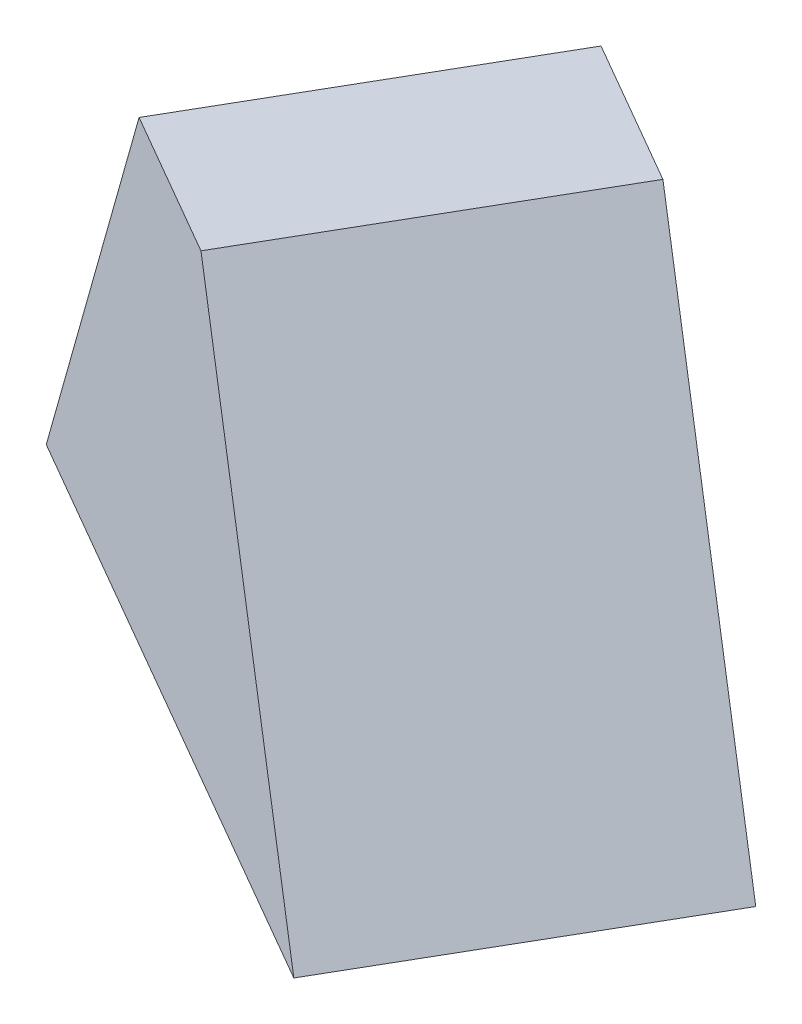
ISO-10303-21;
HEADER;
FILE_DESCRIPTION(('STEP AP214'),'2;1');
FILE_NAME('part.step','',(''),(''),'','','');
FILE_SCHEMA(('AUTOMOTIVE_DESIGN { 1 0 10303 214 1 1 1 1 }'));
ENDSEC;
DATA;
#1=APPLICATION_CONTEXT('core data for automotive mechanical design processes');
#2=APPLICATION_PROTOCOL_DEFINITION('international standard','automotive_design',2000,#1);
#3=PRODUCT_CONTEXT('',#1,'mechanical');
#4=PRODUCT('Part','Part','',(#3));
#5=PRODUCT_RELATED_PRODUCT_CATEGORY('part','',(#4));
#6=PRODUCT_DEFINITION_FORMATION('','',#4);
#7=PRODUCT_DEFINITION_CONTEXT('part definition',#1,'design');
#8=PRODUCT_DEFINITION('design','',#6,#7);
#9=PRODUCT_DEFINITION_SHAPE('','',#8);
#10=(LENGTH_UNIT() NAMED_UNIT(*) SI_UNIT(.MILLI.,.METRE.));
#11=(NAMED_UNIT(*) PLANE_ANGLE_UNIT() SI_UNIT($,.RADIAN.));
#12=(NAMED_UNIT(*) SI_UNIT($,.STERADIAN.) SOLID_ANGLE_UNIT());
#13=UNCERTAINTY_MEASURE_WITH_UNIT(LENGTH_MEASURE(1.E-05),#10,'distance_accuracy_value','');
#14=(GEOMETRIC_REPRESENTATION_CONTEXT(3) GLOBAL_UNCERTAINTY_ASSIGNED_CONTEXT((#13)) GLOBAL_UNIT_ASSIGNED_CONTEXT((#10,
#11,#12)) REPRESENTATION_CONTEXT('',''));
#15=CARTESIAN_POINT('',(0.,0.,0.));
#16=DIRECTION('',(0.,0.,1.));
#17=DIRECTION('',(1.,0.,0.));
#18=AXIS2_PLACEMENT_3D('',#15,#16,#17);
#19=CARTESIAN_POINT('',(-11.9046665872162,0.,10.));
#20=DIRECTION('',(0.,1.,0.));
#21=DIRECTION('',(0.,0.,1.));
#22=AXIS2_PLACEMENT_3D('',#19,#20,#21);
#23=PLANE('',#22);
#24=DIRECTION('',(-0.866025403784442,0.,-0.499999999999995));
#25=VECTOR('',#24,1.);
#26=CARTESIAN_POINT('',(57.3773657155392,0.,49.9999999999996));
#27=LINE('',#26,#25);
#28=CARTESIAN_POINT('',(57.3773657155392,0.,49.9999999999996));
#29=VERTEX_POINT('',#28);
#30=CARTESIAN_POINT('',(-11.9046665872162,0.,10.));
#31=VERTEX_POINT('',#30);
#32=EDGE_CURVE('E88',#29,#31,#27,.T.);
#33=ORIENTED_EDGE('',*,*,#32,.F.);
#34=DIRECTION('',(0.499999999999995,0.,-0.866025403784442));
#35=VECTOR('',#34,1.);
#36=CARTESIAN_POINT('',(37.3773657155394,0.,84.6410161513772));
#37=LINE('',#36,#35);
#38=CARTESIAN_POINT('',(37.3773657155394,0.,84.6410161513772));
#39=VERTEX_POINT('',#38);
#40=EDGE_CURVE('E117',#39,#29,#37,.T.);
#41=ORIENTED_EDGE('',*,*,#40,.F.);
#42=DIRECTION('',(0.866025403784442,0.,0.499999999999995));
#43=VECTOR('',#42,1.);
#44=CARTESIAN_POINT('',(-31.9046665872159,0.,44.6410161513777));
#45=LINE('',#44,#43);
#46=CARTESIAN_POINT('',(-31.9046665872159,0.,44.6410161513777));
#47=VERTEX_POINT('',#46);
#48=EDGE_CURVE('E89',#47,#39,#45,.T.);
#49=ORIENTED_EDGE('',*,*,#48,.F.);
#50=DIRECTION('',(-0.499999999999995,0.,0.866025403784442));
#51=VECTOR('',#50,1.);
#52=CARTESIAN_POINT('',(-11.9046665872162,0.,10.));
#53=LINE('',#52,#51);
#54=EDGE_CURVE('E85',#31,#47,#53,.T.);
#55=ORIENTED_EDGE('',*,*,#54,.F.);
#56=EDGE_LOOP('',(#33,#41,#49,#55));
#57=FACE_BOUND('',#56,.T.);
#58=ADVANCED_FACE('F38',(#57),#23,.F.);
#59=CARTESIAN_POINT('',(31.3966036020062,54.,34.9999999999997));
#60=DIRECTION('',(0.,-1.,0.));
#61=DIRECTION('',(0.,0.,-1.));
#62=AXIS2_PLACEMENT_3D('',#59,#60,#61);
#63=PLANE('',#62);
#64=DIRECTION('',(-0.866025403784439,0.,-0.499999999999999));
#65=VECTOR('',#64,1.);
#66=CARTESIAN_POINT('',(31.3966036020062,54.,34.9999999999997));
#67=LINE('',#66,#65);
#68=CARTESIAN_POINT('',(31.3966036020062,54.,34.9999999999997));
#69=VERTEX_POINT('',#68);
#70=CARTESIAN_POINT('',(14.0760955263172,54.,24.9999999999996));
#71=VERTEX_POINT('',#70);
#72=EDGE_CURVE('E127',#69,#71,#67,.T.);
#73=ORIENTED_EDGE('',*,*,#72,.T.);
#74=DIRECTION('',(-0.5,0.,0.866025403784439));
#75=VECTOR('',#74,1.);
#76=CARTESIAN_POINT('',(14.0760955263172,54.,24.9999999999996));
#77=LINE('',#76,#75);
#78=CARTESIAN_POINT('',(-5.92390447368277,54.,59.6410161513771));
#79=VERTEX_POINT('',#78);
#80=EDGE_CURVE('E112',#71,#79,#77,.T.);
#81=ORIENTED_EDGE('',*,*,#80,.T.);
#82=DIRECTION('',(0.866025403784439,0.,0.5));
#83=VECTOR('',#82,1.);
#84=CARTESIAN_POINT('',(-5.92390447368277,54.,59.6410161513771));
#85=LINE('',#84,#83);
#86=CARTESIAN_POINT('',(11.3966036020062,54.,69.6410161513773));
#87=VERTEX_POINT('',#86);
#88=EDGE_CURVE('E50',#79,#87,#85,.T.);
#89=ORIENTED_EDGE('',*,*,#88,.T.);
#90=DIRECTION('',(0.5,0.,-0.866025403784439));
#91=VECTOR('',#90,1.);
#92=CARTESIAN_POINT('',(11.3966036020062,54.,69.6410161513773));
#93=LINE('',#92,#91);
#94=EDGE_CURVE('E12',#87,#69,#93,.T.);
#95=ORIENTED_EDGE('',*,*,#94,.T.);
#96=EDGE_LOOP('',(#73,#81,#89,#95));
#97=FACE_BOUND('',#96,.T.);
#98=ADVANCED_FACE('F40',(#97),#63,.F.);
#99=CARTESIAN_POINT('',(-31.9046665872159,0.,44.6410161513777));
#100=DIRECTION('',(-0.499999999999995,0.,0.866025403784442));
#101=DIRECTION('',(0.866025403784442,0.,0.499999999999995));
#102=AXIS2_PLACEMENT_3D('',#99,#100,#101);
#103=PLANE('',#102);
#104=DIRECTION('',(-0.420579115569034,-0.87415727612154,-0.242821465589308));
#105=VECTOR('',#104,1.);
#106=CARTESIAN_POINT('',(-5.92390447368277,54.,59.6410161513771));
#107=LINE('',#106,#105);
#108=EDGE_CURVE('E114',#79,#47,#107,.T.);
#109=ORIENTED_EDGE('',*,*,#108,.T.);
#110=ORIENTED_EDGE('',*,*,#48,.T.);
#111=DIRECTION('',(0.420579115569033,-0.874157276121538,0.242821465589316));
#112=VECTOR('',#111,1.);
#113=CARTESIAN_POINT('',(11.3966036020062,54.,69.6410161513773));
#114=LINE('',#113,#112);
#115=EDGE_CURVE('E65',#87,#39,#114,.T.);
#116=ORIENTED_EDGE('',*,*,#115,.F.);
#117=ORIENTED_EDGE('',*,*,#88,.F.);
#118=EDGE_LOOP('',(#109,#110,#116,#117));
#119=FACE_BOUND('',#118,.T.);
#120=ADVANCED_FACE('F209',(#119),#103,.T.);
#121=CARTESIAN_POINT('',(11.3966036020062,54.,69.6410161513773));
#122=DIRECTION('',(0.75704240802426,0.485642931178632,0.437078638060769));
#123=DIRECTION('',(-0.539949247156039,0.841697576624542,0.));
#124=AXIS2_PLACEMENT_3D('',#121,#122,#123);
#125=PLANE('',#124);
#126=ORIENTED_EDGE('',*,*,#115,.T.);
#127=ORIENTED_EDGE('',*,*,#40,.T.);
#128=DIRECTION('',(0.42057911556903,-0.874157276121539,0.242821465589314));
#129=VECTOR('',#128,1.);
#130=CARTESIAN_POINT('',(31.3966036020062,54.,34.9999999999997));
#131=LINE('',#130,#129);
#132=EDGE_CURVE('E105',#69,#29,#131,.T.);
#133=ORIENTED_EDGE('',*,*,#132,.F.);
#134=ORIENTED_EDGE('',*,*,#94,.F.);
#135=EDGE_LOOP('',(#126,#127,#133,#134));
#136=FACE_BOUND('',#135,.T.);
#137=ADVANCED_FACE('F212',(#136),#125,.T.);
#138=CARTESIAN_POINT('',(-11.9046665872162,0.,10.));
#139=DIRECTION('',(-0.757042408024263,0.485642931178632,-0.437078638060764));
#140=DIRECTION('',(-0.539949247156038,-0.841697576624543,0.));
#141=AXIS2_PLACEMENT_3D('',#138,#139,#140);
#142=PLANE('',#141);
#143=DIRECTION('',(-0.420579115569037,-0.874157276121538,-0.24282146558931));
#144=VECTOR('',#143,1.);
#145=CARTESIAN_POINT('',(14.0760955263172,54.,24.9999999999996));
#146=LINE('',#145,#144);
#147=EDGE_CURVE('E103',#71,#31,#146,.T.);
#148=ORIENTED_EDGE('',*,*,#147,.T.);
#149=ORIENTED_EDGE('',*,*,#54,.T.);
#150=ORIENTED_EDGE('',*,*,#108,.F.);
#151=ORIENTED_EDGE('',*,*,#80,.F.);
#152=EDGE_LOOP('',(#148,#149,#150,#151));
#153=FACE_BOUND('',#152,.T.);
#154=ADVANCED_FACE('F110',(#153),#142,.T.);
#155=CARTESIAN_POINT('',(57.3773657155392,0.,49.9999999999996));
#156=DIRECTION('',(0.499999999999995,0.,-0.866025403784442));
#157=DIRECTION('',(-0.866025403784442,0.,-0.499999999999995));
#158=AXIS2_PLACEMENT_3D('',#155,#156,#157);
#159=PLANE('',#158);
#160=ORIENTED_EDGE('',*,*,#132,.T.);
#161=ORIENTED_EDGE('',*,*,#32,.T.);
#162=ORIENTED_EDGE('',*,*,#147,.F.);
#163=ORIENTED_EDGE('',*,*,#72,.F.);
#164=EDGE_LOOP('',(#160,#161,#162,#163));
#165=FACE_BOUND('',#164,.T.);
#166=ADVANCED_FACE('F102',(#165),#159,.T.);
#167=CLOSED_SHELL('',(#58,#98,#120,#137,#154,#166));
#168=MANIFOLD_SOLID_BREP('B2',#167);
#169=ADVANCED_BREP_SHAPE_REPRESENTATION('',(#18,#168),#14);
#170=SHAPE_DEFINITION_REPRESENTATION(#9,#169);
ENDSEC;
END-ISO-10303-21;
